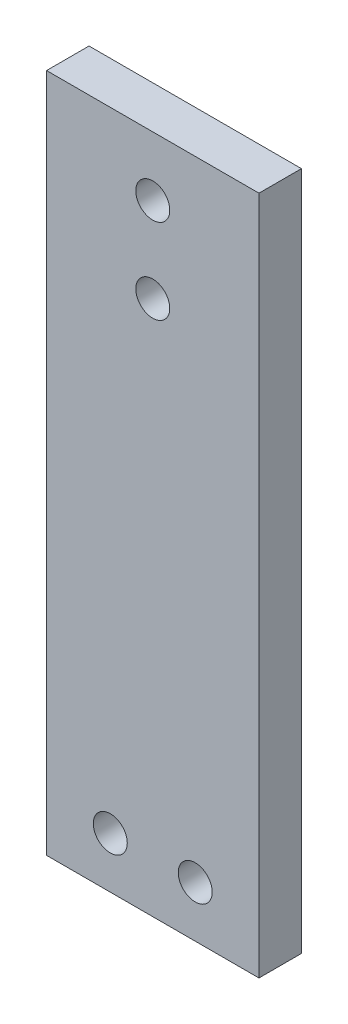
ISO-10303-21;
HEADER;
FILE_DESCRIPTION(('STEP AP214'),'2;1');
FILE_NAME('part.step','',(''),(''),'','','');
FILE_SCHEMA(('AUTOMOTIVE_DESIGN { 1 0 10303 214 1 1 1 1 }'));
ENDSEC;
DATA;
#1=APPLICATION_CONTEXT('core data for automotive mechanical design processes');
#2=APPLICATION_PROTOCOL_DEFINITION('international standard','automotive_design',2000,#1);
#3=PRODUCT_CONTEXT('',#1,'mechanical');
#4=PRODUCT('Part','Part','',(#3));
#5=PRODUCT_RELATED_PRODUCT_CATEGORY('part','',(#4));
#6=PRODUCT_DEFINITION_FORMATION('','',#4);
#7=PRODUCT_DEFINITION_CONTEXT('part definition',#1,'design');
#8=PRODUCT_DEFINITION('design','',#6,#7);
#9=PRODUCT_DEFINITION_SHAPE('','',#8);
#10=(LENGTH_UNIT() NAMED_UNIT(*) SI_UNIT(.MILLI.,.METRE.));
#11=(NAMED_UNIT(*) PLANE_ANGLE_UNIT() SI_UNIT($,.RADIAN.));
#12=(NAMED_UNIT(*) SI_UNIT($,.STERADIAN.) SOLID_ANGLE_UNIT());
#13=UNCERTAINTY_MEASURE_WITH_UNIT(LENGTH_MEASURE(1.E-05),#10,'distance_accuracy_value','');
#14=(GEOMETRIC_REPRESENTATION_CONTEXT(3) GLOBAL_UNCERTAINTY_ASSIGNED_CONTEXT((#13)) GLOBAL_UNIT_ASSIGNED_CONTEXT((#10,
#11,#12)) REPRESENTATION_CONTEXT('',''));
#15=CARTESIAN_POINT('',(0.,0.,0.));
#16=DIRECTION('',(0.,0.,1.));
#17=DIRECTION('',(1.,0.,0.));
#18=AXIS2_PLACEMENT_3D('',#15,#16,#17);
#19=CARTESIAN_POINT('',(12.5,40.,-5.));
#20=DIRECTION('',(1.,0.,0.));
#21=DIRECTION('',(0.,1.,0.));
#22=AXIS2_PLACEMENT_3D('',#19,#20,#21);
#23=PLANE('',#22);
#24=DIRECTION('',(0.,1.,0.));
#25=VECTOR('',#24,1.);
#26=CARTESIAN_POINT('',(12.5,40.,0.));
#27=LINE('',#26,#25);
#28=CARTESIAN_POINT('',(12.5,-40.,0.));
#29=VERTEX_POINT('',#28);
#30=CARTESIAN_POINT('',(12.5,40.,0.));
#31=VERTEX_POINT('',#30);
#32=EDGE_CURVE('E103',#29,#31,#27,.T.);
#33=ORIENTED_EDGE('',*,*,#32,.F.);
#34=DIRECTION('',(0.,0.,1.));
#35=VECTOR('',#34,1.);
#36=CARTESIAN_POINT('',(12.5,-40.,-5.));
#37=LINE('',#36,#35);
#38=CARTESIAN_POINT('',(12.5,-40.,-5.));
#39=VERTEX_POINT('',#38);
#40=EDGE_CURVE('E11',#39,#29,#37,.T.);
#41=ORIENTED_EDGE('',*,*,#40,.F.);
#42=DIRECTION('',(0.,1.,0.));
#43=VECTOR('',#42,1.);
#44=CARTESIAN_POINT('',(12.5,40.,-5.));
#45=LINE('',#44,#43);
#46=CARTESIAN_POINT('',(12.5,40.,-5.));
#47=VERTEX_POINT('',#46);
#48=EDGE_CURVE('E96',#39,#47,#45,.T.);
#49=ORIENTED_EDGE('',*,*,#48,.T.);
#50=DIRECTION('',(0.,0.,1.));
#51=VECTOR('',#50,1.);
#52=CARTESIAN_POINT('',(12.5,40.,-5.));
#53=LINE('',#52,#51);
#54=EDGE_CURVE('E41',#47,#31,#53,.T.);
#55=ORIENTED_EDGE('',*,*,#54,.T.);
#56=EDGE_LOOP('',(#33,#41,#49,#55));
#57=FACE_BOUND('',#56,.T.);
#58=ADVANCED_FACE('F38',(#57),#23,.T.);
#59=CARTESIAN_POINT('',(-12.5,-40.,-5.));
#60=DIRECTION('',(0.,-1.,0.));
#61=DIRECTION('',(0.,0.,-1.));
#62=AXIS2_PLACEMENT_3D('',#59,#60,#61);
#63=PLANE('',#62);
#64=DIRECTION('',(1.,0.,0.));
#65=VECTOR('',#64,1.);
#66=CARTESIAN_POINT('',(-12.5,-40.,0.));
#67=LINE('',#66,#65);
#68=CARTESIAN_POINT('',(-12.5,-40.,0.));
#69=VERTEX_POINT('',#68);
#70=EDGE_CURVE('E98',#69,#29,#67,.T.);
#71=ORIENTED_EDGE('',*,*,#70,.F.);
#72=DIRECTION('',(0.,0.,1.));
#73=VECTOR('',#72,1.);
#74=CARTESIAN_POINT('',(-12.5,-40.,-5.));
#75=LINE('',#74,#73);
#76=CARTESIAN_POINT('',(-12.5,-40.,-5.));
#77=VERTEX_POINT('',#76);
#78=EDGE_CURVE('E47',#77,#69,#75,.T.);
#79=ORIENTED_EDGE('',*,*,#78,.F.);
#80=DIRECTION('',(1.,0.,0.));
#81=VECTOR('',#80,1.);
#82=CARTESIAN_POINT('',(-12.5,-40.,-5.));
#83=LINE('',#82,#81);
#84=EDGE_CURVE('E93',#77,#39,#83,.T.);
#85=ORIENTED_EDGE('',*,*,#84,.T.);
#86=ORIENTED_EDGE('',*,*,#40,.T.);
#87=EDGE_LOOP('',(#71,#79,#85,#86));
#88=FACE_BOUND('',#87,.T.);
#89=ADVANCED_FACE('F114',(#88),#63,.T.);
#90=CARTESIAN_POINT('',(-12.5,40.,-5.));
#91=DIRECTION('',(-1.,0.,0.));
#92=DIRECTION('',(0.,-1.,0.));
#93=AXIS2_PLACEMENT_3D('',#90,#91,#92);
#94=PLANE('',#93);
#95=DIRECTION('',(0.,-1.,0.));
#96=VECTOR('',#95,1.);
#97=CARTESIAN_POINT('',(-12.5,40.,0.));
#98=LINE('',#97,#96);
#99=CARTESIAN_POINT('',(-12.5,40.,0.));
#100=VERTEX_POINT('',#99);
#101=EDGE_CURVE('E88',#100,#69,#98,.T.);
#102=ORIENTED_EDGE('',*,*,#101,.F.);
#103=DIRECTION('',(0.,0.,1.));
#104=VECTOR('',#103,1.);
#105=CARTESIAN_POINT('',(-12.5,40.,-5.));
#106=LINE('',#105,#104);
#107=CARTESIAN_POINT('',(-12.5,40.,-5.));
#108=VERTEX_POINT('',#107);
#109=EDGE_CURVE('E83',#108,#100,#106,.T.);
#110=ORIENTED_EDGE('',*,*,#109,.F.);
#111=DIRECTION('',(0.,-1.,0.));
#112=VECTOR('',#111,1.);
#113=CARTESIAN_POINT('',(-12.5,40.,-5.));
#114=LINE('',#113,#112);
#115=EDGE_CURVE('E86',#108,#77,#114,.T.);
#116=ORIENTED_EDGE('',*,*,#115,.T.);
#117=ORIENTED_EDGE('',*,*,#78,.T.);
#118=EDGE_LOOP('',(#102,#110,#116,#117));
#119=FACE_BOUND('',#118,.T.);
#120=ADVANCED_FACE('F85',(#119),#94,.T.);
#121=CARTESIAN_POINT('',(-12.5,40.,-5.));
#122=DIRECTION('',(0.,1.,0.));
#123=DIRECTION('',(0.,0.,1.));
#124=AXIS2_PLACEMENT_3D('',#121,#122,#123);
#125=PLANE('',#124);
#126=DIRECTION('',(-1.,0.,0.));
#127=VECTOR('',#126,1.);
#128=CARTESIAN_POINT('',(-12.5,40.,0.));
#129=LINE('',#128,#127);
#130=EDGE_CURVE('E106',#31,#100,#129,.T.);
#131=ORIENTED_EDGE('',*,*,#130,.F.);
#132=ORIENTED_EDGE('',*,*,#54,.F.);
#133=DIRECTION('',(-1.,0.,0.));
#134=VECTOR('',#133,1.);
#135=CARTESIAN_POINT('',(-12.5,40.,-5.));
#136=LINE('',#135,#134);
#137=EDGE_CURVE('E92',#47,#108,#136,.T.);
#138=ORIENTED_EDGE('',*,*,#137,.T.);
#139=ORIENTED_EDGE('',*,*,#109,.T.);
#140=EDGE_LOOP('',(#131,#132,#138,#139));
#141=FACE_BOUND('',#140,.T.);
#142=ADVANCED_FACE('F95',(#141),#125,.T.);
#143=CARTESIAN_POINT('',(0.,0.,-5.));
#144=DIRECTION('',(0.,0.,1.));
#145=DIRECTION('',(1.,0.,0.));
#146=AXIS2_PLACEMENT_3D('',#143,#144,#145);
#147=PLANE('',#146);
#148=CARTESIAN_POINT('',(0.,33.,-5.));
#149=DIRECTION('',(0.,0.,1.));
#150=DIRECTION('',(1.,0.,0.));
#151=AXIS2_PLACEMENT_3D('',#148,#149,#150);
#152=CIRCLE('',#151,2.);
#153=CARTESIAN_POINT('',(2.,33.,-5.));
#154=VERTEX_POINT('',#153);
#155=EDGE_CURVE('E107',#154,#154,#152,.T.);
#156=ORIENTED_EDGE('',*,*,#155,.T.);
#157=EDGE_LOOP('',(#156));
#158=FACE_BOUND('',#157,.T.);
#159=CARTESIAN_POINT('',(0.,23.,-5.));
#160=DIRECTION('',(0.,0.,1.));
#161=DIRECTION('',(1.,0.,0.));
#162=AXIS2_PLACEMENT_3D('',#159,#160,#161);
#163=CIRCLE('',#162,2.);
#164=CARTESIAN_POINT('',(2.,23.,-5.));
#165=VERTEX_POINT('',#164);
#166=EDGE_CURVE('E162',#165,#165,#163,.T.);
#167=ORIENTED_EDGE('',*,*,#166,.T.);
#168=EDGE_LOOP('',(#167));
#169=FACE_BOUND('',#168,.T.);
#170=CARTESIAN_POINT('',(-5.,-34.,-5.));
#171=DIRECTION('',(0.,0.,1.));
#172=DIRECTION('',(1.,0.,0.));
#173=AXIS2_PLACEMENT_3D('',#170,#171,#172);
#174=CIRCLE('',#173,2.);
#175=CARTESIAN_POINT('',(-2.99999999999999,-34.,-5.));
#176=VERTEX_POINT('',#175);
#177=EDGE_CURVE('E170',#176,#176,#174,.T.);
#178=ORIENTED_EDGE('',*,*,#177,.T.);
#179=EDGE_LOOP('',(#178));
#180=FACE_BOUND('',#179,.T.);
#181=CARTESIAN_POINT('',(5.00000000000001,-34.,-5.));
#182=DIRECTION('',(0.,0.,1.));
#183=DIRECTION('',(1.,0.,0.));
#184=AXIS2_PLACEMENT_3D('',#181,#182,#183);
#185=CIRCLE('',#184,2.);
#186=CARTESIAN_POINT('',(7.00000000000001,-34.,-5.));
#187=VERTEX_POINT('',#186);
#188=EDGE_CURVE('E175',#187,#187,#185,.T.);
#189=ORIENTED_EDGE('',*,*,#188,.T.);
#190=EDGE_LOOP('',(#189));
#191=FACE_BOUND('',#190,.T.);
#192=ORIENTED_EDGE('',*,*,#48,.F.);
#193=ORIENTED_EDGE('',*,*,#84,.F.);
#194=ORIENTED_EDGE('',*,*,#115,.F.);
#195=ORIENTED_EDGE('',*,*,#137,.F.);
#196=EDGE_LOOP('',(#192,#193,#194,#195));
#197=FACE_BOUND('',#196,.T.);
#198=ADVANCED_FACE('F91',(#158,#169,#180,#191,#197),#147,.F.);
#199=CARTESIAN_POINT('',(0.,0.,0.));
#200=DIRECTION('',(0.,0.,1.));
#201=DIRECTION('',(1.,0.,0.));
#202=AXIS2_PLACEMENT_3D('',#199,#200,#201);
#203=PLANE('',#202);
#204=CARTESIAN_POINT('',(0.,33.,0.));
#205=DIRECTION('',(0.,0.,1.));
#206=DIRECTION('',(1.,0.,0.));
#207=AXIS2_PLACEMENT_3D('',#204,#205,#206);
#208=CIRCLE('',#207,2.);
#209=CARTESIAN_POINT('',(2.,33.,0.));
#210=VERTEX_POINT('',#209);
#211=EDGE_CURVE('E157',#210,#210,#208,.T.);
#212=ORIENTED_EDGE('',*,*,#211,.F.);
#213=EDGE_LOOP('',(#212));
#214=FACE_BOUND('',#213,.T.);
#215=CARTESIAN_POINT('',(0.,23.,0.));
#216=DIRECTION('',(0.,0.,1.));
#217=DIRECTION('',(1.,0.,0.));
#218=AXIS2_PLACEMENT_3D('',#215,#216,#217);
#219=CIRCLE('',#218,2.);
#220=CARTESIAN_POINT('',(2.,23.,0.));
#221=VERTEX_POINT('',#220);
#222=EDGE_CURVE('E158',#221,#221,#219,.T.);
#223=ORIENTED_EDGE('',*,*,#222,.F.);
#224=EDGE_LOOP('',(#223));
#225=FACE_BOUND('',#224,.T.);
#226=CARTESIAN_POINT('',(-5.,-34.,0.));
#227=DIRECTION('',(0.,0.,1.));
#228=DIRECTION('',(1.,0.,0.));
#229=AXIS2_PLACEMENT_3D('',#226,#227,#228);
#230=CIRCLE('',#229,2.);
#231=CARTESIAN_POINT('',(-2.99999999999999,-34.,0.));
#232=VERTEX_POINT('',#231);
#233=EDGE_CURVE('E167',#232,#232,#230,.T.);
#234=ORIENTED_EDGE('',*,*,#233,.F.);
#235=EDGE_LOOP('',(#234));
#236=FACE_BOUND('',#235,.T.);
#237=CARTESIAN_POINT('',(5.00000000000001,-34.,0.));
#238=DIRECTION('',(0.,0.,1.));
#239=DIRECTION('',(1.,0.,0.));
#240=AXIS2_PLACEMENT_3D('',#237,#238,#239);
#241=CIRCLE('',#240,2.);
#242=CARTESIAN_POINT('',(7.00000000000001,-34.,0.));
#243=VERTEX_POINT('',#242);
#244=EDGE_CURVE('E173',#243,#243,#241,.T.);
#245=ORIENTED_EDGE('',*,*,#244,.F.);
#246=EDGE_LOOP('',(#245));
#247=FACE_BOUND('',#246,.T.);
#248=ORIENTED_EDGE('',*,*,#32,.T.);
#249=ORIENTED_EDGE('',*,*,#130,.T.);
#250=ORIENTED_EDGE('',*,*,#101,.T.);
#251=ORIENTED_EDGE('',*,*,#70,.T.);
#252=EDGE_LOOP('',(#248,#249,#250,#251));
#253=FACE_BOUND('',#252,.T.);
#254=ADVANCED_FACE('F113',(#214,#225,#236,#247,#253),#203,.T.);
#255=CARTESIAN_POINT('',(5.00000000000001,-34.,-5.));
#256=DIRECTION('',(0.,0.,1.));
#257=DIRECTION('',(1.,0.,0.));
#258=AXIS2_PLACEMENT_3D('',#255,#256,#257);
#259=CYLINDRICAL_SURFACE('',#258,2.);
#260=ORIENTED_EDGE('',*,*,#188,.F.);
#261=EDGE_LOOP('',(#260));
#262=FACE_BOUND('',#261,.T.);
#263=ORIENTED_EDGE('',*,*,#244,.T.);
#264=EDGE_LOOP('',(#263));
#265=FACE_BOUND('',#264,.T.);
#266=ADVANCED_FACE('F132',(#262,#265),#259,.F.);
#267=CARTESIAN_POINT('',(-5.,-34.,-5.));
#268=DIRECTION('',(0.,0.,1.));
#269=DIRECTION('',(1.,0.,0.));
#270=AXIS2_PLACEMENT_3D('',#267,#268,#269);
#271=CYLINDRICAL_SURFACE('',#270,2.);
#272=ORIENTED_EDGE('',*,*,#177,.F.);
#273=EDGE_LOOP('',(#272));
#274=FACE_BOUND('',#273,.T.);
#275=ORIENTED_EDGE('',*,*,#233,.T.);
#276=EDGE_LOOP('',(#275));
#277=FACE_BOUND('',#276,.T.);
#278=ADVANCED_FACE('F139',(#274,#277),#271,.F.);
#279=CARTESIAN_POINT('',(0.,23.,-5.));
#280=DIRECTION('',(0.,0.,1.));
#281=DIRECTION('',(1.,0.,0.));
#282=AXIS2_PLACEMENT_3D('',#279,#280,#281);
#283=CYLINDRICAL_SURFACE('',#282,2.);
#284=ORIENTED_EDGE('',*,*,#166,.F.);
#285=EDGE_LOOP('',(#284));
#286=FACE_BOUND('',#285,.T.);
#287=ORIENTED_EDGE('',*,*,#222,.T.);
#288=EDGE_LOOP('',(#287));
#289=FACE_BOUND('',#288,.T.);
#290=ADVANCED_FACE('F143',(#286,#289),#283,.F.);
#291=CARTESIAN_POINT('',(0.,33.,-5.));
#292=DIRECTION('',(0.,0.,1.));
#293=DIRECTION('',(1.,0.,0.));
#294=AXIS2_PLACEMENT_3D('',#291,#292,#293);
#295=CYLINDRICAL_SURFACE('',#294,2.);
#296=ORIENTED_EDGE('',*,*,#155,.F.);
#297=EDGE_LOOP('',(#296));
#298=FACE_BOUND('',#297,.T.);
#299=ORIENTED_EDGE('',*,*,#211,.T.);
#300=EDGE_LOOP('',(#299));
#301=FACE_BOUND('',#300,.T.);
#302=ADVANCED_FACE('F147',(#298,#301),#295,.F.);
#303=CLOSED_SHELL('',(#58,#89,#120,#142,#198,#254,#266,#278,#290,#302));
#304=MANIFOLD_SOLID_BREP('B2',#303);
#305=ADVANCED_BREP_SHAPE_REPRESENTATION('',(#18,#304),#14);
#306=SHAPE_DEFINITION_REPRESENTATION(#9,#305);
ENDSEC;
END-ISO-10303-21;
